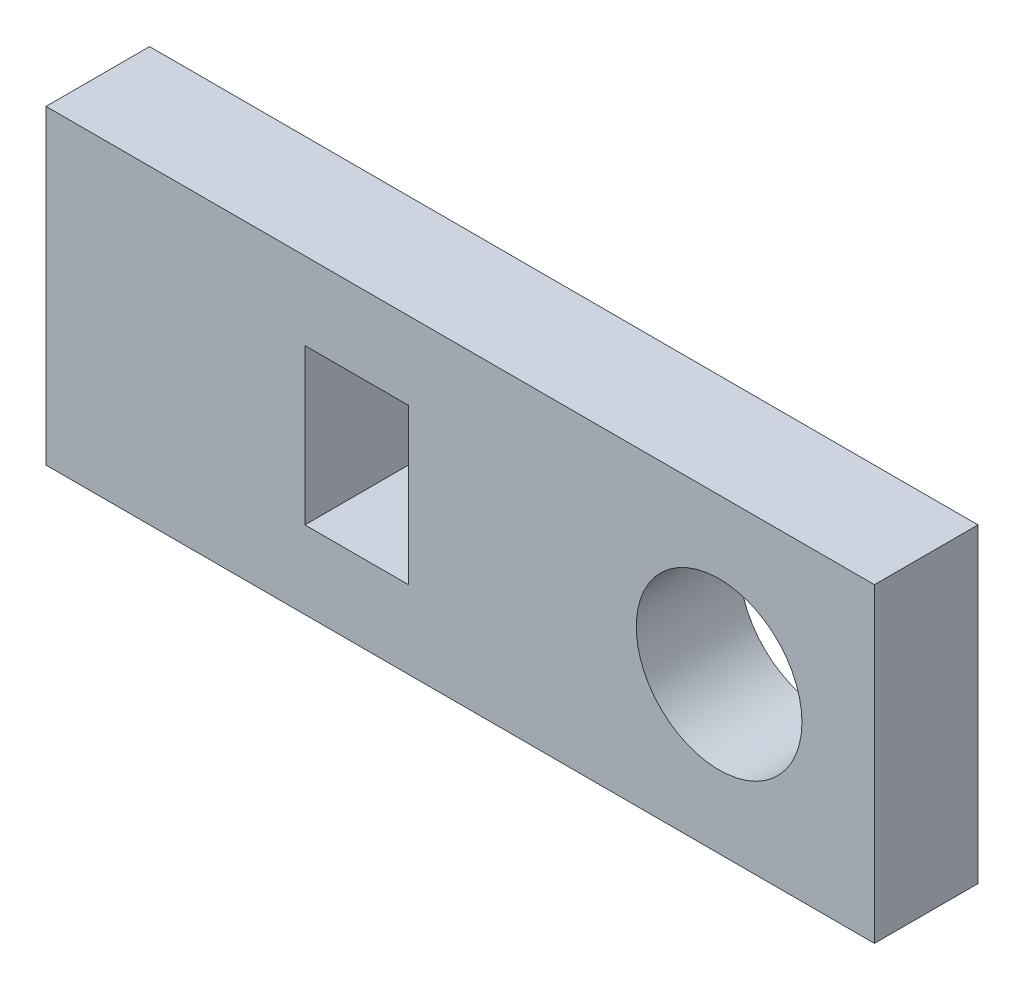
ISO-10303-21;
HEADER;
FILE_DESCRIPTION(('STEP AP214'),'2;1');
FILE_NAME('part.step','',(''),(''),'','','');
FILE_SCHEMA(('AUTOMOTIVE_DESIGN { 1 0 10303 214 1 1 1 1 }'));
ENDSEC;
DATA;
#1=APPLICATION_CONTEXT('core data for automotive mechanical design processes');
#2=APPLICATION_PROTOCOL_DEFINITION('international standard','automotive_design',2000,#1);
#3=PRODUCT_CONTEXT('',#1,'mechanical');
#4=PRODUCT('Part','Part','',(#3));
#5=PRODUCT_RELATED_PRODUCT_CATEGORY('part','',(#4));
#6=PRODUCT_DEFINITION_FORMATION('','',#4);
#7=PRODUCT_DEFINITION_CONTEXT('part definition',#1,'design');
#8=PRODUCT_DEFINITION('design','',#6,#7);
#9=PRODUCT_DEFINITION_SHAPE('','',#8);
#10=(LENGTH_UNIT() NAMED_UNIT(*) SI_UNIT(.MILLI.,.METRE.));
#11=(NAMED_UNIT(*) PLANE_ANGLE_UNIT() SI_UNIT($,.RADIAN.));
#12=(NAMED_UNIT(*) SI_UNIT($,.STERADIAN.) SOLID_ANGLE_UNIT());
#13=UNCERTAINTY_MEASURE_WITH_UNIT(LENGTH_MEASURE(1.E-05),#10,'distance_accuracy_value','');
#14=(GEOMETRIC_REPRESENTATION_CONTEXT(3) GLOBAL_UNCERTAINTY_ASSIGNED_CONTEXT((#13)) GLOBAL_UNIT_ASSIGNED_CONTEXT((#10,
#11,#12)) REPRESENTATION_CONTEXT('',''));
#15=CARTESIAN_POINT('',(0.,0.,0.));
#16=DIRECTION('',(0.,0.,1.));
#17=DIRECTION('',(1.,0.,0.));
#18=AXIS2_PLACEMENT_3D('',#15,#16,#17);
#19=CARTESIAN_POINT('',(0.,15.,5.));
#20=DIRECTION('',(0.,0.,-1.));
#21=DIRECTION('',(-1.,0.,0.));
#22=AXIS2_PLACEMENT_3D('',#19,#20,#21);
#23=PLANE('',#22);
#24=CARTESIAN_POINT('',(32.5,7.5,5.));
#25=DIRECTION('',(0.,0.,1.));
#26=DIRECTION('',(1.,0.,0.));
#27=AXIS2_PLACEMENT_3D('',#24,#25,#26);
#28=CIRCLE('',#27,4.);
#29=CARTESIAN_POINT('',(36.5,7.5,5.));
#30=VERTEX_POINT('',#29);
#31=EDGE_CURVE('E131',#30,#30,#28,.T.);
#32=ORIENTED_EDGE('',*,*,#31,.F.);
#33=EDGE_LOOP('',(#32));
#34=FACE_BOUND('',#33,.T.);
#35=DIRECTION('',(0.,-1.,0.));
#36=VECTOR('',#35,1.);
#37=CARTESIAN_POINT('',(0.,0.,5.));
#38=LINE('',#37,#36);
#39=CARTESIAN_POINT('',(0.,15.,5.));
#40=VERTEX_POINT('',#39);
#41=CARTESIAN_POINT('',(0.,0.,5.));
#42=VERTEX_POINT('',#41);
#43=EDGE_CURVE('E137',#40,#42,#38,.T.);
#44=ORIENTED_EDGE('',*,*,#43,.T.);
#45=DIRECTION('',(1.,0.,0.));
#46=VECTOR('',#45,1.);
#47=CARTESIAN_POINT('',(0.,0.,5.));
#48=LINE('',#47,#46);
#49=CARTESIAN_POINT('',(40.,0.,5.));
#50=VERTEX_POINT('',#49);
#51=EDGE_CURVE('E140',#42,#50,#48,.T.);
#52=ORIENTED_EDGE('',*,*,#51,.T.);
#53=DIRECTION('',(0.,1.,0.));
#54=VECTOR('',#53,1.);
#55=CARTESIAN_POINT('',(40.,0.,5.));
#56=LINE('',#55,#54);
#57=CARTESIAN_POINT('',(40.,15.,5.));
#58=VERTEX_POINT('',#57);
#59=EDGE_CURVE('E143',#50,#58,#56,.T.);
#60=ORIENTED_EDGE('',*,*,#59,.T.);
#61=DIRECTION('',(-1.,0.,0.));
#62=VECTOR('',#61,1.);
#63=CARTESIAN_POINT('',(0.,15.,5.));
#64=LINE('',#63,#62);
#65=EDGE_CURVE('E145',#58,#40,#64,.T.);
#66=ORIENTED_EDGE('',*,*,#65,.T.);
#67=EDGE_LOOP('',(#44,#52,#60,#66));
#68=FACE_BOUND('',#67,.T.);
#69=DIRECTION('',(0.,-1.,0.));
#70=VECTOR('',#69,1.);
#71=CARTESIAN_POINT('',(12.5,11.25,5.));
#72=LINE('',#71,#70);
#73=CARTESIAN_POINT('',(12.5,11.25,5.));
#74=VERTEX_POINT('',#73);
#75=CARTESIAN_POINT('',(12.5,3.75,5.));
#76=VERTEX_POINT('',#75);
#77=EDGE_CURVE('E95',#74,#76,#72,.T.);
#78=ORIENTED_EDGE('',*,*,#77,.F.);
#79=DIRECTION('',(-1.,0.,0.));
#80=VECTOR('',#79,1.);
#81=CARTESIAN_POINT('',(12.5,11.25,5.));
#82=LINE('',#81,#80);
#83=CARTESIAN_POINT('',(17.5,11.25,5.));
#84=VERTEX_POINT('',#83);
#85=EDGE_CURVE('E117',#84,#74,#82,.T.);
#86=ORIENTED_EDGE('',*,*,#85,.F.);
#87=DIRECTION('',(0.,1.,0.));
#88=VECTOR('',#87,1.);
#89=CARTESIAN_POINT('',(17.5,11.25,5.));
#90=LINE('',#89,#88);
#91=CARTESIAN_POINT('',(17.5,3.75,5.));
#92=VERTEX_POINT('',#91);
#93=EDGE_CURVE('E115',#92,#84,#90,.T.);
#94=ORIENTED_EDGE('',*,*,#93,.F.);
#95=DIRECTION('',(1.,0.,0.));
#96=VECTOR('',#95,1.);
#97=CARTESIAN_POINT('',(12.5,3.75,5.));
#98=LINE('',#97,#96);
#99=EDGE_CURVE('E103',#76,#92,#98,.T.);
#100=ORIENTED_EDGE('',*,*,#99,.F.);
#101=EDGE_LOOP('',(#78,#86,#94,#100));
#102=FACE_BOUND('',#101,.T.);
#103=ADVANCED_FACE('F30',(#34,#68,#102),#23,.F.);
#104=CARTESIAN_POINT('',(0.,15.,0.));
#105=DIRECTION('',(0.,0.,-1.));
#106=DIRECTION('',(-1.,0.,0.));
#107=AXIS2_PLACEMENT_3D('',#104,#105,#106);
#108=PLANE('',#107);
#109=CARTESIAN_POINT('',(32.5,7.5,0.));
#110=DIRECTION('',(0.,0.,1.));
#111=DIRECTION('',(1.,0.,0.));
#112=AXIS2_PLACEMENT_3D('',#109,#110,#111);
#113=CIRCLE('',#112,4.);
#114=CARTESIAN_POINT('',(36.5,7.5,0.));
#115=VERTEX_POINT('',#114);
#116=EDGE_CURVE('E111',#115,#115,#113,.T.);
#117=ORIENTED_EDGE('',*,*,#116,.T.);
#118=EDGE_LOOP('',(#117));
#119=FACE_BOUND('',#118,.T.);
#120=DIRECTION('',(0.,-1.,0.));
#121=VECTOR('',#120,1.);
#122=CARTESIAN_POINT('',(0.,0.,0.));
#123=LINE('',#122,#121);
#124=CARTESIAN_POINT('',(0.,15.,0.));
#125=VERTEX_POINT('',#124);
#126=CARTESIAN_POINT('',(0.,0.,0.));
#127=VERTEX_POINT('',#126);
#128=EDGE_CURVE('E134',#125,#127,#123,.T.);
#129=ORIENTED_EDGE('',*,*,#128,.F.);
#130=DIRECTION('',(-1.,0.,0.));
#131=VECTOR('',#130,1.);
#132=CARTESIAN_POINT('',(0.,15.,0.));
#133=LINE('',#132,#131);
#134=CARTESIAN_POINT('',(40.,15.,0.));
#135=VERTEX_POINT('',#134);
#136=EDGE_CURVE('E141',#135,#125,#133,.T.);
#137=ORIENTED_EDGE('',*,*,#136,.F.);
#138=DIRECTION('',(0.,1.,0.));
#139=VECTOR('',#138,1.);
#140=CARTESIAN_POINT('',(40.,0.,0.));
#141=LINE('',#140,#139);
#142=CARTESIAN_POINT('',(40.,0.,0.));
#143=VERTEX_POINT('',#142);
#144=EDGE_CURVE('E152',#143,#135,#141,.T.);
#145=ORIENTED_EDGE('',*,*,#144,.F.);
#146=DIRECTION('',(1.,0.,0.));
#147=VECTOR('',#146,1.);
#148=CARTESIAN_POINT('',(0.,0.,0.));
#149=LINE('',#148,#147);
#150=EDGE_CURVE('E150',#127,#143,#149,.T.);
#151=ORIENTED_EDGE('',*,*,#150,.F.);
#152=EDGE_LOOP('',(#129,#137,#145,#151));
#153=FACE_BOUND('',#152,.T.);
#154=DIRECTION('',(-1.,0.,0.));
#155=VECTOR('',#154,1.);
#156=CARTESIAN_POINT('',(12.5,11.25,0.));
#157=LINE('',#156,#155);
#158=CARTESIAN_POINT('',(17.5,11.25,0.));
#159=VERTEX_POINT('',#158);
#160=CARTESIAN_POINT('',(12.5,11.25,0.));
#161=VERTEX_POINT('',#160);
#162=EDGE_CURVE('E104',#159,#161,#157,.T.);
#163=ORIENTED_EDGE('',*,*,#162,.T.);
#164=DIRECTION('',(0.,-1.,0.));
#165=VECTOR('',#164,1.);
#166=CARTESIAN_POINT('',(12.5,11.25,0.));
#167=LINE('',#166,#165);
#168=CARTESIAN_POINT('',(12.5,3.75,0.));
#169=VERTEX_POINT('',#168);
#170=EDGE_CURVE('E53',#161,#169,#167,.T.);
#171=ORIENTED_EDGE('',*,*,#170,.T.);
#172=DIRECTION('',(1.,0.,0.));
#173=VECTOR('',#172,1.);
#174=CARTESIAN_POINT('',(12.5,3.75,0.));
#175=LINE('',#174,#173);
#176=CARTESIAN_POINT('',(17.5,3.75,0.));
#177=VERTEX_POINT('',#176);
#178=EDGE_CURVE('E110',#169,#177,#175,.T.);
#179=ORIENTED_EDGE('',*,*,#178,.T.);
#180=DIRECTION('',(0.,1.,0.));
#181=VECTOR('',#180,1.);
#182=CARTESIAN_POINT('',(17.5,11.25,0.));
#183=LINE('',#182,#181);
#184=EDGE_CURVE('E123',#177,#159,#183,.T.);
#185=ORIENTED_EDGE('',*,*,#184,.T.);
#186=EDGE_LOOP('',(#163,#171,#179,#185));
#187=FACE_BOUND('',#186,.T.);
#188=ADVANCED_FACE('F170',(#119,#153,#187),#108,.T.);
#189=CARTESIAN_POINT('',(0.,0.,5.));
#190=DIRECTION('',(1.,0.,0.));
#191=DIRECTION('',(0.,0.,-1.));
#192=AXIS2_PLACEMENT_3D('',#189,#190,#191);
#193=PLANE('',#192);
#194=ORIENTED_EDGE('',*,*,#128,.T.);
#195=DIRECTION('',(0.,0.,-1.));
#196=VECTOR('',#195,1.);
#197=CARTESIAN_POINT('',(0.,0.,5.));
#198=LINE('',#197,#196);
#199=EDGE_CURVE('E11',#42,#127,#198,.T.);
#200=ORIENTED_EDGE('',*,*,#199,.F.);
#201=ORIENTED_EDGE('',*,*,#43,.F.);
#202=DIRECTION('',(0.,0.,-1.));
#203=VECTOR('',#202,1.);
#204=CARTESIAN_POINT('',(0.,15.,5.));
#205=LINE('',#204,#203);
#206=EDGE_CURVE('E147',#40,#125,#205,.T.);
#207=ORIENTED_EDGE('',*,*,#206,.T.);
#208=EDGE_LOOP('',(#194,#200,#201,#207));
#209=FACE_BOUND('',#208,.T.);
#210=ADVANCED_FACE('F32',(#209),#193,.F.);
#211=CARTESIAN_POINT('',(0.,0.,5.));
#212=DIRECTION('',(0.,1.,0.));
#213=DIRECTION('',(0.,0.,1.));
#214=AXIS2_PLACEMENT_3D('',#211,#212,#213);
#215=PLANE('',#214);
#216=ORIENTED_EDGE('',*,*,#150,.T.);
#217=DIRECTION('',(0.,0.,-1.));
#218=VECTOR('',#217,1.);
#219=CARTESIAN_POINT('',(40.,0.,5.));
#220=LINE('',#219,#218);
#221=EDGE_CURVE('E38',#50,#143,#220,.T.);
#222=ORIENTED_EDGE('',*,*,#221,.F.);
#223=ORIENTED_EDGE('',*,*,#51,.F.);
#224=ORIENTED_EDGE('',*,*,#199,.T.);
#225=EDGE_LOOP('',(#216,#222,#223,#224));
#226=FACE_BOUND('',#225,.T.);
#227=ADVANCED_FACE('F180',(#226),#215,.F.);
#228=CARTESIAN_POINT('',(40.,0.,5.));
#229=DIRECTION('',(-1.,0.,0.));
#230=DIRECTION('',(0.,0.,1.));
#231=AXIS2_PLACEMENT_3D('',#228,#229,#230);
#232=PLANE('',#231);
#233=ORIENTED_EDGE('',*,*,#144,.T.);
#234=DIRECTION('',(0.,0.,-1.));
#235=VECTOR('',#234,1.);
#236=CARTESIAN_POINT('',(40.,15.,5.));
#237=LINE('',#236,#235);
#238=EDGE_CURVE('E157',#58,#135,#237,.T.);
#239=ORIENTED_EDGE('',*,*,#238,.F.);
#240=ORIENTED_EDGE('',*,*,#59,.F.);
#241=ORIENTED_EDGE('',*,*,#221,.T.);
#242=EDGE_LOOP('',(#233,#239,#240,#241));
#243=FACE_BOUND('',#242,.T.);
#244=ADVANCED_FACE('F164',(#243),#232,.F.);
#245=CARTESIAN_POINT('',(0.,15.,5.));
#246=DIRECTION('',(0.,-1.,0.));
#247=DIRECTION('',(0.,0.,-1.));
#248=AXIS2_PLACEMENT_3D('',#245,#246,#247);
#249=PLANE('',#248);
#250=ORIENTED_EDGE('',*,*,#136,.T.);
#251=ORIENTED_EDGE('',*,*,#206,.F.);
#252=ORIENTED_EDGE('',*,*,#65,.F.);
#253=ORIENTED_EDGE('',*,*,#238,.T.);
#254=EDGE_LOOP('',(#250,#251,#252,#253));
#255=FACE_BOUND('',#254,.T.);
#256=ADVANCED_FACE('F174',(#255),#249,.F.);
#257=CARTESIAN_POINT('',(32.5,7.5,5.));
#258=DIRECTION('',(0.,0.,-1.));
#259=DIRECTION('',(-1.,0.,0.));
#260=AXIS2_PLACEMENT_3D('',#257,#258,#259);
#261=CYLINDRICAL_SURFACE('',#260,4.);
#262=ORIENTED_EDGE('',*,*,#31,.T.);
#263=EDGE_LOOP('',(#262));
#264=FACE_BOUND('',#263,.T.);
#265=ORIENTED_EDGE('',*,*,#116,.F.);
#266=EDGE_LOOP('',(#265));
#267=FACE_BOUND('',#266,.T.);
#268=ADVANCED_FACE('F197',(#264,#267),#261,.F.);
#269=CARTESIAN_POINT('',(12.5,11.25,5.));
#270=DIRECTION('',(1.,0.,0.));
#271=DIRECTION('',(0.,0.,-1.));
#272=AXIS2_PLACEMENT_3D('',#269,#270,#271);
#273=PLANE('',#272);
#274=ORIENTED_EDGE('',*,*,#170,.F.);
#275=DIRECTION('',(0.,0.,-1.));
#276=VECTOR('',#275,1.);
#277=CARTESIAN_POINT('',(12.5,11.25,5.));
#278=LINE('',#277,#276);
#279=EDGE_CURVE('E99',#74,#161,#278,.T.);
#280=ORIENTED_EDGE('',*,*,#279,.F.);
#281=ORIENTED_EDGE('',*,*,#77,.T.);
#282=DIRECTION('',(0.,0.,-1.));
#283=VECTOR('',#282,1.);
#284=CARTESIAN_POINT('',(12.5,3.75,5.));
#285=LINE('',#284,#283);
#286=EDGE_CURVE('E98',#76,#169,#285,.T.);
#287=ORIENTED_EDGE('',*,*,#286,.T.);
#288=EDGE_LOOP('',(#274,#280,#281,#287));
#289=FACE_BOUND('',#288,.T.);
#290=ADVANCED_FACE('F97',(#289),#273,.T.);
#291=CARTESIAN_POINT('',(12.5,3.75,5.));
#292=DIRECTION('',(0.,1.,0.));
#293=DIRECTION('',(0.,0.,1.));
#294=AXIS2_PLACEMENT_3D('',#291,#292,#293);
#295=PLANE('',#294);
#296=ORIENTED_EDGE('',*,*,#178,.F.);
#297=ORIENTED_EDGE('',*,*,#286,.F.);
#298=ORIENTED_EDGE('',*,*,#99,.T.);
#299=DIRECTION('',(0.,0.,-1.));
#300=VECTOR('',#299,1.);
#301=CARTESIAN_POINT('',(17.5,3.75,5.));
#302=LINE('',#301,#300);
#303=EDGE_CURVE('E112',#92,#177,#302,.T.);
#304=ORIENTED_EDGE('',*,*,#303,.T.);
#305=EDGE_LOOP('',(#296,#297,#298,#304));
#306=FACE_BOUND('',#305,.T.);
#307=ADVANCED_FACE('F107',(#306),#295,.T.);
#308=CARTESIAN_POINT('',(17.5,11.25,5.));
#309=DIRECTION('',(-1.,0.,0.));
#310=DIRECTION('',(0.,0.,1.));
#311=AXIS2_PLACEMENT_3D('',#308,#309,#310);
#312=PLANE('',#311);
#313=ORIENTED_EDGE('',*,*,#184,.F.);
#314=ORIENTED_EDGE('',*,*,#303,.F.);
#315=ORIENTED_EDGE('',*,*,#93,.T.);
#316=DIRECTION('',(0.,0.,-1.));
#317=VECTOR('',#316,1.);
#318=CARTESIAN_POINT('',(17.5,11.25,5.));
#319=LINE('',#318,#317);
#320=EDGE_CURVE('E45',#84,#159,#319,.T.);
#321=ORIENTED_EDGE('',*,*,#320,.T.);
#322=EDGE_LOOP('',(#313,#314,#315,#321));
#323=FACE_BOUND('',#322,.T.);
#324=ADVANCED_FACE('F213',(#323),#312,.T.);
#325=CARTESIAN_POINT('',(12.5,11.25,5.));
#326=DIRECTION('',(0.,-1.,0.));
#327=DIRECTION('',(0.,0.,-1.));
#328=AXIS2_PLACEMENT_3D('',#325,#326,#327);
#329=PLANE('',#328);
#330=ORIENTED_EDGE('',*,*,#162,.F.);
#331=ORIENTED_EDGE('',*,*,#320,.F.);
#332=ORIENTED_EDGE('',*,*,#85,.T.);
#333=ORIENTED_EDGE('',*,*,#279,.T.);
#334=EDGE_LOOP('',(#330,#331,#332,#333));
#335=FACE_BOUND('',#334,.T.);
#336=ADVANCED_FACE('F218',(#335),#329,.T.);
#337=CLOSED_SHELL('',(#103,#188,#210,#227,#244,#256,#268,#290,#307,#324,#336));
#338=MANIFOLD_SOLID_BREP('B2',#337);
#339=ADVANCED_BREP_SHAPE_REPRESENTATION('',(#18,#338),#14);
#340=SHAPE_DEFINITION_REPRESENTATION(#9,#339);
ENDSEC;
END-ISO-10303-21;
